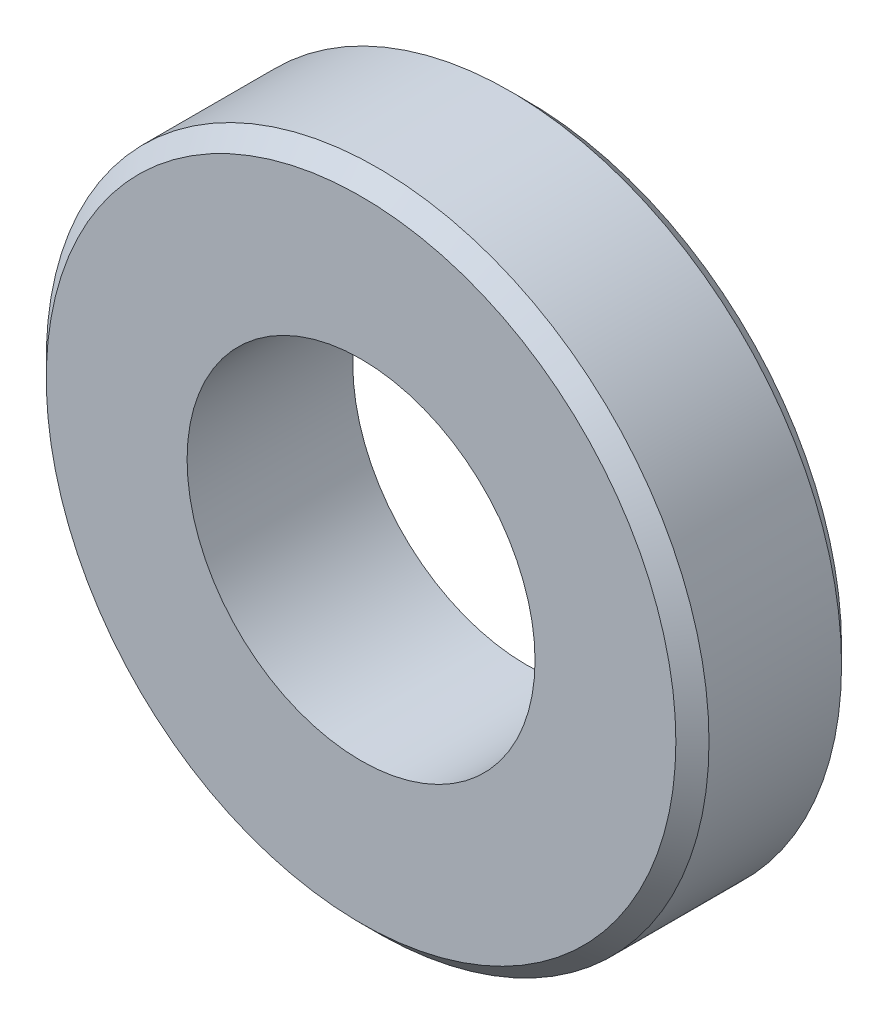
ISO-10303-21;
HEADER;
FILE_DESCRIPTION(('STEP AP214'),'2;1');
FILE_NAME('part.step','',(''),(''),'','','');
FILE_SCHEMA(('AUTOMOTIVE_DESIGN { 1 0 10303 214 1 1 1 1 }'));
ENDSEC;
DATA;
#1=APPLICATION_CONTEXT('core data for automotive mechanical design processes');
#2=APPLICATION_PROTOCOL_DEFINITION('international standard','automotive_design',2000,#1);
#3=PRODUCT_CONTEXT('',#1,'mechanical');
#4=PRODUCT('Part','Part','',(#3));
#5=PRODUCT_RELATED_PRODUCT_CATEGORY('part','',(#4));
#6=PRODUCT_DEFINITION_FORMATION('','',#4);
#7=PRODUCT_DEFINITION_CONTEXT('part definition',#1,'design');
#8=PRODUCT_DEFINITION('design','',#6,#7);
#9=PRODUCT_DEFINITION_SHAPE('','',#8);
#10=(LENGTH_UNIT() NAMED_UNIT(*) SI_UNIT(.MILLI.,.METRE.));
#11=(NAMED_UNIT(*) PLANE_ANGLE_UNIT() SI_UNIT($,.RADIAN.));
#12=(NAMED_UNIT(*) SI_UNIT($,.STERADIAN.) SOLID_ANGLE_UNIT());
#13=UNCERTAINTY_MEASURE_WITH_UNIT(LENGTH_MEASURE(1.E-05),#10,'distance_accuracy_value','');
#14=(GEOMETRIC_REPRESENTATION_CONTEXT(3) GLOBAL_UNCERTAINTY_ASSIGNED_CONTEXT((#13)) GLOBAL_UNIT_ASSIGNED_CONTEXT((#10,
#11,#12)) REPRESENTATION_CONTEXT('',''));
#15=CARTESIAN_POINT('',(0.,0.,0.));
#16=DIRECTION('',(0.,0.,1.));
#17=DIRECTION('',(1.,0.,0.));
#18=AXIS2_PLACEMENT_3D('',#15,#16,#17);
#19=CARTESIAN_POINT('',(0.,0.,-1.));
#20=DIRECTION('',(0.,0.,-1.));
#21=DIRECTION('',(1.,0.,0.));
#22=AXIS2_PLACEMENT_3D('',#19,#20,#21);
#23=PLANE('',#22);
#24=CARTESIAN_POINT('',(0.,0.,-1.));
#25=DIRECTION('',(0.,0.,1.));
#26=DIRECTION('',(1.,0.,0.));
#27=AXIS2_PLACEMENT_3D('',#24,#25,#26);
#28=CIRCLE('',#27,3.8);
#29=CARTESIAN_POINT('',(3.8,0.,-1.));
#30=VERTEX_POINT('',#29);
#31=EDGE_CURVE('E10',#30,#30,#28,.T.);
#32=ORIENTED_EDGE('',*,*,#31,.F.);
#33=EDGE_LOOP('',(#32));
#34=FACE_BOUND('',#33,.T.);
#35=CARTESIAN_POINT('',(0.,0.,-1.));
#36=DIRECTION('',(0.,0.,1.));
#37=DIRECTION('',(1.,0.,0.));
#38=AXIS2_PLACEMENT_3D('',#35,#36,#37);
#39=CIRCLE('',#38,2.1);
#40=CARTESIAN_POINT('',(2.1,0.,-1.));
#41=VERTEX_POINT('',#40);
#42=EDGE_CURVE('E55',#41,#41,#39,.T.);
#43=ORIENTED_EDGE('',*,*,#42,.T.);
#44=EDGE_LOOP('',(#43));
#45=FACE_BOUND('',#44,.T.);
#46=ADVANCED_FACE('F35',(#34,#45),#23,.T.);
#47=CARTESIAN_POINT('',(0.,0.,1.));
#48=DIRECTION('',(0.,0.,-1.));
#49=DIRECTION('',(1.,0.,0.));
#50=AXIS2_PLACEMENT_3D('',#47,#48,#49);
#51=PLANE('',#50);
#52=CARTESIAN_POINT('',(0.,0.,1.));
#53=DIRECTION('',(0.,0.,1.));
#54=DIRECTION('',(1.,0.,0.));
#55=AXIS2_PLACEMENT_3D('',#52,#53,#54);
#56=CIRCLE('',#55,3.8);
#57=CARTESIAN_POINT('',(3.8,0.,1.));
#58=VERTEX_POINT('',#57);
#59=EDGE_CURVE('E42',#58,#58,#56,.F.);
#60=ORIENTED_EDGE('',*,*,#59,.F.);
#61=EDGE_LOOP('',(#60));
#62=FACE_BOUND('',#61,.T.);
#63=CARTESIAN_POINT('',(0.,0.,1.));
#64=DIRECTION('',(0.,0.,1.));
#65=DIRECTION('',(1.,0.,0.));
#66=AXIS2_PLACEMENT_3D('',#63,#64,#65);
#67=CIRCLE('',#66,2.1);
#68=CARTESIAN_POINT('',(2.1,0.,1.));
#69=VERTEX_POINT('',#68);
#70=EDGE_CURVE('E56',#69,#69,#67,.T.);
#71=ORIENTED_EDGE('',*,*,#70,.F.);
#72=EDGE_LOOP('',(#71));
#73=FACE_BOUND('',#72,.T.);
#74=ADVANCED_FACE('F71',(#62,#73),#51,.F.);
#75=CARTESIAN_POINT('',(0.,0.,-1.));
#76=DIRECTION('',(0.,0.,1.));
#77=DIRECTION('',(-1.,0.,0.));
#78=AXIS2_PLACEMENT_3D('',#75,#76,#77);
#79=CYLINDRICAL_SURFACE('',#78,4.);
#80=CARTESIAN_POINT('',(0.,0.,0.799999999999999));
#81=DIRECTION('',(0.,0.,1.));
#82=DIRECTION('',(1.,0.,0.));
#83=AXIS2_PLACEMENT_3D('',#80,#81,#82);
#84=CIRCLE('',#83,4.);
#85=CARTESIAN_POINT('',(4.,0.,0.799999999999999));
#86=VERTEX_POINT('',#85);
#87=EDGE_CURVE('E46',#86,#86,#84,.T.);
#88=ORIENTED_EDGE('',*,*,#87,.F.);
#89=EDGE_LOOP('',(#88));
#90=FACE_BOUND('',#89,.T.);
#91=CARTESIAN_POINT('',(0.,0.,-0.799999999999999));
#92=DIRECTION('',(0.,0.,1.));
#93=DIRECTION('',(1.,0.,0.));
#94=AXIS2_PLACEMENT_3D('',#91,#92,#93);
#95=CIRCLE('',#94,4.);
#96=CARTESIAN_POINT('',(4.,0.,-0.799999999999999));
#97=VERTEX_POINT('',#96);
#98=EDGE_CURVE('E50',#97,#97,#95,.F.);
#99=ORIENTED_EDGE('',*,*,#98,.F.);
#100=EDGE_LOOP('',(#99));
#101=FACE_BOUND('',#100,.T.);
#102=ADVANCED_FACE('F67',(#90,#101),#79,.T.);
#103=CARTESIAN_POINT('',(0.,0.,-1.));
#104=DIRECTION('',(0.,0.,1.));
#105=DIRECTION('',(-1.,0.,0.));
#106=AXIS2_PLACEMENT_3D('',#103,#104,#105);
#107=CYLINDRICAL_SURFACE('',#106,2.1);
#108=ORIENTED_EDGE('',*,*,#42,.F.);
#109=EDGE_LOOP('',(#108));
#110=FACE_BOUND('',#109,.T.);
#111=ORIENTED_EDGE('',*,*,#70,.T.);
#112=EDGE_LOOP('',(#111));
#113=FACE_BOUND('',#112,.T.);
#114=ADVANCED_FACE('F63',(#110,#113),#107,.F.);
#115=CARTESIAN_POINT('',(0.,0.,0.799999999999999));
#116=DIRECTION('',(0.,0.,-1.));
#117=DIRECTION('',(1.,0.,0.));
#118=AXIS2_PLACEMENT_3D('',#115,#116,#117);
#119=CONICAL_SURFACE('',#118,4.,0.785398163397453);
#120=ORIENTED_EDGE('',*,*,#59,.T.);
#121=EDGE_LOOP('',(#120));
#122=FACE_BOUND('',#121,.T.);
#123=ORIENTED_EDGE('',*,*,#87,.T.);
#124=EDGE_LOOP('',(#123));
#125=FACE_BOUND('',#124,.T.);
#126=ADVANCED_FACE('F66',(#122,#125),#119,.T.);
#127=CARTESIAN_POINT('',(0.,0.,-1.));
#128=DIRECTION('',(0.,0.,1.));
#129=DIRECTION('',(-1.,0.,0.));
#130=AXIS2_PLACEMENT_3D('',#127,#128,#129);
#131=CONICAL_SURFACE('',#130,3.8,0.785398163397444);
#132=ORIENTED_EDGE('',*,*,#98,.T.);
#133=EDGE_LOOP('',(#132));
#134=FACE_BOUND('',#133,.T.);
#135=ORIENTED_EDGE('',*,*,#31,.T.);
#136=EDGE_LOOP('',(#135));
#137=FACE_BOUND('',#136,.T.);
#138=ADVANCED_FACE('F37',(#134,#137),#131,.T.);
#139=CLOSED_SHELL('',(#46,#74,#102,#114,#126,#138));
#140=MANIFOLD_SOLID_BREP('B2',#139);
#141=ADVANCED_BREP_SHAPE_REPRESENTATION('',(#18,#140),#14);
#142=SHAPE_DEFINITION_REPRESENTATION(#9,#141);
ENDSEC;
END-ISO-10303-21;
